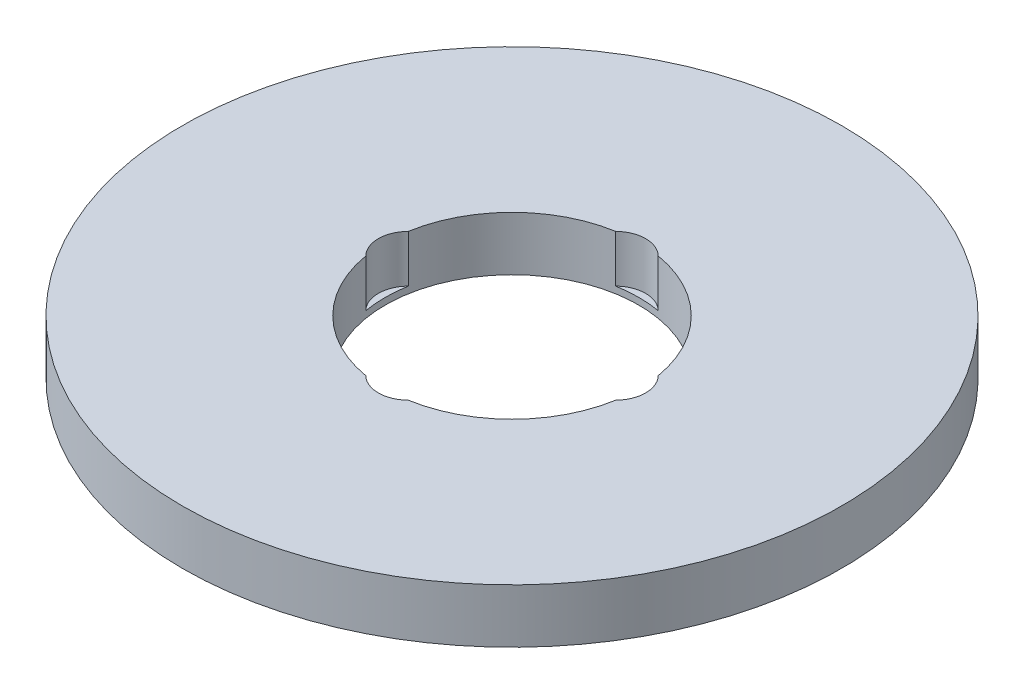
ISO-10303-21;
HEADER;
FILE_DESCRIPTION(('STEP AP214'),'2;1');
FILE_NAME('part.step','',(''),(''),'','','');
FILE_SCHEMA(('AUTOMOTIVE_DESIGN { 1 0 10303 214 1 1 1 1 }'));
ENDSEC;
DATA;
#1=APPLICATION_CONTEXT('core data for automotive mechanical design processes');
#2=APPLICATION_PROTOCOL_DEFINITION('international standard','automotive_design',2000,#1);
#3=PRODUCT_CONTEXT('',#1,'mechanical');
#4=PRODUCT('Part','Part','',(#3));
#5=PRODUCT_RELATED_PRODUCT_CATEGORY('part','',(#4));
#6=PRODUCT_DEFINITION_FORMATION('','',#4);
#7=PRODUCT_DEFINITION_CONTEXT('part definition',#1,'design');
#8=PRODUCT_DEFINITION('design','',#6,#7);
#9=PRODUCT_DEFINITION_SHAPE('','',#8);
#10=(LENGTH_UNIT() NAMED_UNIT(*) SI_UNIT(.MILLI.,.METRE.));
#11=(NAMED_UNIT(*) PLANE_ANGLE_UNIT() SI_UNIT($,.RADIAN.));
#12=(NAMED_UNIT(*) SI_UNIT($,.STERADIAN.) SOLID_ANGLE_UNIT());
#13=UNCERTAINTY_MEASURE_WITH_UNIT(LENGTH_MEASURE(1.E-05),#10,'distance_accuracy_value','');
#14=(GEOMETRIC_REPRESENTATION_CONTEXT(3) GLOBAL_UNCERTAINTY_ASSIGNED_CONTEXT((#13)) GLOBAL_UNIT_ASSIGNED_CONTEXT((#10,
#11,#12)) REPRESENTATION_CONTEXT('',''));
#15=CARTESIAN_POINT('',(0.,0.,0.));
#16=DIRECTION('',(0.,0.,1.));
#17=DIRECTION('',(1.,0.,0.));
#18=AXIS2_PLACEMENT_3D('',#15,#16,#17);
#19=CARTESIAN_POINT('',(0.,16.,0.));
#20=DIRECTION('',(0.,-1.,0.));
#21=DIRECTION('',(0.,0.,-1.));
#22=AXIS2_PLACEMENT_3D('',#19,#20,#21);
#23=CYLINDRICAL_SURFACE('',#22,97.5);
#24=CARTESIAN_POINT('',(0.,16.,0.));
#25=DIRECTION('',(0.,1.,0.));
#26=DIRECTION('',(0.,0.,1.));
#27=AXIS2_PLACEMENT_3D('',#24,#25,#26);
#28=CIRCLE('',#27,97.5);
#29=CARTESIAN_POINT('',(0.,16.,97.5));
#30=VERTEX_POINT('',#29);
#31=EDGE_CURVE('E148',#30,#30,#28,.T.);
#32=ORIENTED_EDGE('',*,*,#31,.F.);
#33=EDGE_LOOP('',(#32));
#34=FACE_BOUND('',#33,.T.);
#35=CARTESIAN_POINT('',(0.,0.,0.));
#36=DIRECTION('',(0.,1.,0.));
#37=DIRECTION('',(0.,0.,1.));
#38=AXIS2_PLACEMENT_3D('',#35,#36,#37);
#39=CIRCLE('',#38,97.5);
#40=CARTESIAN_POINT('',(0.,0.,97.5));
#41=VERTEX_POINT('',#40);
#42=EDGE_CURVE('E139',#41,#41,#39,.T.);
#43=ORIENTED_EDGE('',*,*,#42,.T.);
#44=EDGE_LOOP('',(#43));
#45=FACE_BOUND('',#44,.T.);
#46=ADVANCED_FACE('F39',(#34,#45),#23,.T.);
#47=CARTESIAN_POINT('',(0.,16.,0.));
#48=DIRECTION('',(0.,1.,0.));
#49=DIRECTION('',(0.,0.,1.));
#50=AXIS2_PLACEMENT_3D('',#47,#48,#49);
#51=PLANE('',#50);
#52=CARTESIAN_POINT('',(1.06638424816963E-13,16.,30.5424587640203));
#53=DIRECTION('',(0.,1.,0.));
#54=DIRECTION('',(1.,0.,0.));
#55=AXIS2_PLACEMENT_3D('',#52,#53,#54);
#56=CIRCLE('',#55,8.99695651911864);
#57=CARTESIAN_POINT('',(-6.29811100717771,16.,36.9673341984686));
#58=VERTEX_POINT('',#57);
#59=CARTESIAN_POINT('',(6.29811100717797,16.,36.9673341984686));
#60=VERTEX_POINT('',#59);
#61=EDGE_CURVE('E175',#58,#60,#56,.T.);
#62=ORIENTED_EDGE('',*,*,#61,.F.);
#63=CARTESIAN_POINT('',(0.,16.,0.));
#64=DIRECTION('',(0.,1.,0.));
#65=DIRECTION('',(0.,0.,1.));
#66=AXIS2_PLACEMENT_3D('',#63,#64,#65);
#67=CIRCLE('',#66,37.5);
#68=CARTESIAN_POINT('',(-36.9673341984686,16.,6.29811100717784));
#69=VERTEX_POINT('',#68);
#70=EDGE_CURVE('E134',#69,#58,#67,.T.);
#71=ORIENTED_EDGE('',*,*,#70,.F.);
#72=CARTESIAN_POINT('',(-30.5424587640203,16.,0.));
#73=DIRECTION('',(0.,1.,0.));
#74=DIRECTION('',(0.,0.,1.));
#75=AXIS2_PLACEMENT_3D('',#72,#73,#74);
#76=CIRCLE('',#75,8.99695651911864);
#77=CARTESIAN_POINT('',(-36.9673341984686,16.,-6.29811100717784));
#78=VERTEX_POINT('',#77);
#79=EDGE_CURVE('E143',#78,#69,#76,.T.);
#80=ORIENTED_EDGE('',*,*,#79,.F.);
#81=CARTESIAN_POINT('',(-6.29811100717823,16.,-36.9673341984685));
#82=VERTEX_POINT('',#81);
#83=EDGE_CURVE('E123',#82,#78,#67,.T.);
#84=ORIENTED_EDGE('',*,*,#83,.F.);
#85=CARTESIAN_POINT('',(-3.19915274450889E-13,16.,-30.5424587640203));
#86=DIRECTION('',(0.,1.,0.));
#87=DIRECTION('',(-1.,0.,0.));
#88=AXIS2_PLACEMENT_3D('',#85,#86,#87);
#89=CIRCLE('',#88,8.99695651911864);
#90=CARTESIAN_POINT('',(6.29811100717746,16.,-36.9673341984687));
#91=VERTEX_POINT('',#90);
#92=EDGE_CURVE('E106',#91,#82,#89,.T.);
#93=ORIENTED_EDGE('',*,*,#92,.F.);
#94=CARTESIAN_POINT('',(36.9673341984686,16.,-6.29811100717784));
#95=VERTEX_POINT('',#94);
#96=EDGE_CURVE('E125',#95,#91,#67,.T.);
#97=ORIENTED_EDGE('',*,*,#96,.F.);
#98=CARTESIAN_POINT('',(30.5424587640203,16.,0.));
#99=DIRECTION('',(0.,1.,0.));
#100=DIRECTION('',(0.,0.,-1.));
#101=AXIS2_PLACEMENT_3D('',#98,#99,#100);
#102=CIRCLE('',#101,8.99695651911864);
#103=CARTESIAN_POINT('',(36.9673341984686,16.,6.29811100717784));
#104=VERTEX_POINT('',#103);
#105=EDGE_CURVE('E286',#104,#95,#102,.T.);
#106=ORIENTED_EDGE('',*,*,#105,.F.);
#107=EDGE_CURVE('E135',#60,#104,#67,.T.);
#108=ORIENTED_EDGE('',*,*,#107,.F.);
#109=EDGE_LOOP('',(#62,#71,#80,#84,#93,#97,#106,#108));
#110=FACE_BOUND('',#109,.T.);
#111=ORIENTED_EDGE('',*,*,#31,.T.);
#112=EDGE_LOOP('',(#111));
#113=FACE_BOUND('',#112,.T.);
#114=ADVANCED_FACE('F118',(#110,#113),#51,.T.);
#115=CARTESIAN_POINT('',(0.,0.,0.));
#116=DIRECTION('',(0.,1.,0.));
#117=DIRECTION('',(0.,0.,1.));
#118=AXIS2_PLACEMENT_3D('',#115,#116,#117);
#119=PLANE('',#118);
#120=CARTESIAN_POINT('',(0.,0.,0.));
#121=DIRECTION('',(0.,1.,0.));
#122=DIRECTION('',(0.,0.,1.));
#123=AXIS2_PLACEMENT_3D('',#120,#121,#122);
#124=CIRCLE('',#123,37.5);
#125=CARTESIAN_POINT('',(0.,0.,37.5));
#126=VERTEX_POINT('',#125);
#127=EDGE_CURVE('E136',#126,#126,#124,.T.);
#128=ORIENTED_EDGE('',*,*,#127,.T.);
#129=EDGE_LOOP('',(#128));
#130=FACE_BOUND('',#129,.T.);
#131=ORIENTED_EDGE('',*,*,#42,.F.);
#132=EDGE_LOOP('',(#131));
#133=FACE_BOUND('',#132,.T.);
#134=ADVANCED_FACE('F187',(#130,#133),#119,.F.);
#135=CARTESIAN_POINT('',(0.,16.,0.));
#136=DIRECTION('',(0.,-1.,0.));
#137=DIRECTION('',(0.,0.,-1.));
#138=AXIS2_PLACEMENT_3D('',#135,#136,#137);
#139=CYLINDRICAL_SURFACE('',#138,37.5);
#140=DIRECTION('',(0.,1.,0.));
#141=VECTOR('',#140,1.);
#142=CARTESIAN_POINT('',(-6.29811100717771,8.98591771003932,36.9673341984686));
#143=LINE('',#142,#141);
#144=CARTESIAN_POINT('',(-6.29811100717771,1.97183542007863,36.9673341984686));
#145=VERTEX_POINT('',#144);
#146=EDGE_CURVE('E11',#145,#58,#143,.T.);
#147=ORIENTED_EDGE('',*,*,#146,.F.);
#148=CARTESIAN_POINT('',(0.,1.97183542007863,0.));
#149=DIRECTION('',(0.,1.,0.));
#150=DIRECTION('',(0.,0.,1.));
#151=AXIS2_PLACEMENT_3D('',#148,#149,#150);
#152=CIRCLE('',#151,37.5);
#153=CARTESIAN_POINT('',(6.29811100717797,1.97183542007863,36.9673341984686));
#154=VERTEX_POINT('',#153);
#155=EDGE_CURVE('E170',#145,#154,#152,.T.);
#156=ORIENTED_EDGE('',*,*,#155,.T.);
#157=DIRECTION('',(0.,1.,0.));
#158=VECTOR('',#157,1.);
#159=CARTESIAN_POINT('',(6.29811100717797,8.98591771003932,36.9673341984686));
#160=LINE('',#159,#158);
#161=EDGE_CURVE('E46',#60,#154,#160,.F.);
#162=ORIENTED_EDGE('',*,*,#161,.F.);
#163=ORIENTED_EDGE('',*,*,#107,.T.);
#164=DIRECTION('',(0.,1.,0.));
#165=VECTOR('',#164,1.);
#166=CARTESIAN_POINT('',(36.9673341984686,8.98591771003932,6.29811100717784));
#167=LINE('',#166,#165);
#168=CARTESIAN_POINT('',(36.9673341984686,1.97183542007863,6.29811100717784));
#169=VERTEX_POINT('',#168);
#170=EDGE_CURVE('E164',#169,#104,#167,.T.);
#171=ORIENTED_EDGE('',*,*,#170,.F.);
#172=CARTESIAN_POINT('',(0.,1.97183542007863,0.));
#173=DIRECTION('',(0.,1.,0.));
#174=DIRECTION('',(0.,0.,1.));
#175=AXIS2_PLACEMENT_3D('',#172,#173,#174);
#176=CIRCLE('',#175,37.5);
#177=CARTESIAN_POINT('',(36.9673341984686,1.97183542007863,-6.29811100717784));
#178=VERTEX_POINT('',#177);
#179=EDGE_CURVE('E115',#169,#178,#176,.T.);
#180=ORIENTED_EDGE('',*,*,#179,.T.);
#181=DIRECTION('',(0.,1.,0.));
#182=VECTOR('',#181,1.);
#183=CARTESIAN_POINT('',(36.9673341984686,8.98591771003932,-6.29811100717784));
#184=LINE('',#183,#182);
#185=EDGE_CURVE('E131',#95,#178,#184,.F.);
#186=ORIENTED_EDGE('',*,*,#185,.F.);
#187=ORIENTED_EDGE('',*,*,#96,.T.);
#188=DIRECTION('',(0.,1.,0.));
#189=VECTOR('',#188,1.);
#190=CARTESIAN_POINT('',(6.29811100717746,8.98591771003932,-36.9673341984687));
#191=LINE('',#190,#189);
#192=CARTESIAN_POINT('',(6.29811100717746,1.97183542007863,-36.9673341984687));
#193=VERTEX_POINT('',#192);
#194=EDGE_CURVE('E105',#193,#91,#191,.T.);
#195=ORIENTED_EDGE('',*,*,#194,.F.);
#196=CARTESIAN_POINT('',(0.,1.97183542007863,0.));
#197=DIRECTION('',(0.,1.,0.));
#198=DIRECTION('',(0.,0.,1.));
#199=AXIS2_PLACEMENT_3D('',#196,#197,#198);
#200=CIRCLE('',#199,37.5);
#201=CARTESIAN_POINT('',(-6.29811100717823,1.97183542007863,-36.9673341984685));
#202=VERTEX_POINT('',#201);
#203=EDGE_CURVE('E159',#193,#202,#200,.T.);
#204=ORIENTED_EDGE('',*,*,#203,.T.);
#205=DIRECTION('',(0.,1.,0.));
#206=VECTOR('',#205,1.);
#207=CARTESIAN_POINT('',(-6.29811100717823,8.98591771003932,-36.9673341984685));
#208=LINE('',#207,#206);
#209=EDGE_CURVE('E114',#82,#202,#208,.F.);
#210=ORIENTED_EDGE('',*,*,#209,.F.);
#211=ORIENTED_EDGE('',*,*,#83,.T.);
#212=DIRECTION('',(0.,1.,0.));
#213=VECTOR('',#212,1.);
#214=CARTESIAN_POINT('',(-36.9673341984686,8.98591771003932,-6.29811100717784));
#215=LINE('',#214,#213);
#216=CARTESIAN_POINT('',(-36.9673341984686,1.97183542007863,-6.29811100717784));
#217=VERTEX_POINT('',#216);
#218=EDGE_CURVE('E160',#217,#78,#215,.T.);
#219=ORIENTED_EDGE('',*,*,#218,.F.);
#220=CARTESIAN_POINT('',(0.,1.97183542007863,0.));
#221=DIRECTION('',(0.,1.,0.));
#222=DIRECTION('',(0.,0.,1.));
#223=AXIS2_PLACEMENT_3D('',#220,#221,#222);
#224=CIRCLE('',#223,37.5);
#225=CARTESIAN_POINT('',(-36.9673341984686,1.97183542007863,6.29811100717784));
#226=VERTEX_POINT('',#225);
#227=EDGE_CURVE('E149',#217,#226,#224,.T.);
#228=ORIENTED_EDGE('',*,*,#227,.T.);
#229=DIRECTION('',(0.,1.,0.));
#230=VECTOR('',#229,1.);
#231=CARTESIAN_POINT('',(-36.9673341984686,8.98591771003932,6.29811100717784));
#232=LINE('',#231,#230);
#233=EDGE_CURVE('E152',#69,#226,#232,.F.);
#234=ORIENTED_EDGE('',*,*,#233,.F.);
#235=ORIENTED_EDGE('',*,*,#70,.T.);
#236=EDGE_LOOP('',(#147,#156,#162,#163,#171,#180,#186,#187,#195,#204,#210,#211,#219,#228,#234,#235));
#237=FACE_BOUND('',#236,.T.);
#238=ORIENTED_EDGE('',*,*,#127,.F.);
#239=EDGE_LOOP('',(#238));
#240=FACE_BOUND('',#239,.T.);
#241=ADVANCED_FACE('F126',(#237,#240),#139,.F.);
#242=CARTESIAN_POINT('',(-30.5424587640203,1.97183542007863,0.));
#243=DIRECTION('',(0.,1.,0.));
#244=DIRECTION('',(0.,0.,1.));
#245=AXIS2_PLACEMENT_3D('',#242,#243,#244);
#246=CYLINDRICAL_SURFACE('',#245,8.99695651911864);
#247=ORIENTED_EDGE('',*,*,#218,.T.);
#248=ORIENTED_EDGE('',*,*,#79,.T.);
#249=ORIENTED_EDGE('',*,*,#233,.T.);
#250=CARTESIAN_POINT('',(-30.5424587640203,1.97183542007863,0.));
#251=DIRECTION('',(0.,1.,0.));
#252=DIRECTION('',(0.,0.,1.));
#253=AXIS2_PLACEMENT_3D('',#250,#251,#252);
#254=CIRCLE('',#253,8.99695651911864);
#255=EDGE_CURVE('E144',#217,#226,#254,.T.);
#256=ORIENTED_EDGE('',*,*,#255,.F.);
#257=EDGE_LOOP('',(#247,#248,#249,#256));
#258=FACE_BOUND('',#257,.T.);
#259=ADVANCED_FACE('F200',(#258),#246,.F.);
#260=CARTESIAN_POINT('',(-30.5424587640203,1.97183542007863,0.));
#261=DIRECTION('',(0.,1.,0.));
#262=DIRECTION('',(0.,0.,1.));
#263=AXIS2_PLACEMENT_3D('',#260,#261,#262);
#264=PLANE('',#263);
#265=ORIENTED_EDGE('',*,*,#255,.T.);
#266=ORIENTED_EDGE('',*,*,#227,.F.);
#267=EDGE_LOOP('',(#265,#266));
#268=FACE_BOUND('',#267,.T.);
#269=ADVANCED_FACE('F201',(#268),#264,.T.);
#270=CARTESIAN_POINT('',(-3.19915274450889E-13,1.97183542007863,-30.5424587640203));
#271=DIRECTION('',(0.,1.,0.));
#272=DIRECTION('',(0.,0.,1.));
#273=AXIS2_PLACEMENT_3D('',#270,#271,#272);
#274=CYLINDRICAL_SURFACE('',#273,8.99695651911864);
#275=ORIENTED_EDGE('',*,*,#194,.T.);
#276=ORIENTED_EDGE('',*,*,#92,.T.);
#277=ORIENTED_EDGE('',*,*,#209,.T.);
#278=CARTESIAN_POINT('',(-3.19915274450889E-13,1.97183542007863,-30.5424587640203));
#279=DIRECTION('',(0.,1.,0.));
#280=DIRECTION('',(-1.,0.,0.));
#281=AXIS2_PLACEMENT_3D('',#278,#279,#280);
#282=CIRCLE('',#281,8.99695651911864);
#283=EDGE_CURVE('E107',#193,#202,#282,.T.);
#284=ORIENTED_EDGE('',*,*,#283,.F.);
#285=EDGE_LOOP('',(#275,#276,#277,#284));
#286=FACE_BOUND('',#285,.T.);
#287=ADVANCED_FACE('F102',(#286),#274,.F.);
#288=CARTESIAN_POINT('',(-3.19915274450889E-13,1.97183542007863,-30.5424587640203));
#289=DIRECTION('',(0.,1.,0.));
#290=DIRECTION('',(-1.,0.,0.));
#291=AXIS2_PLACEMENT_3D('',#288,#289,#290);
#292=PLANE('',#291);
#293=ORIENTED_EDGE('',*,*,#283,.T.);
#294=ORIENTED_EDGE('',*,*,#203,.F.);
#295=EDGE_LOOP('',(#293,#294));
#296=FACE_BOUND('',#295,.T.);
#297=ADVANCED_FACE('F209',(#296),#292,.T.);
#298=CARTESIAN_POINT('',(30.5424587640203,1.97183542007863,0.));
#299=DIRECTION('',(0.,1.,0.));
#300=DIRECTION('',(0.,0.,1.));
#301=AXIS2_PLACEMENT_3D('',#298,#299,#300);
#302=CYLINDRICAL_SURFACE('',#301,8.99695651911864);
#303=ORIENTED_EDGE('',*,*,#170,.T.);
#304=ORIENTED_EDGE('',*,*,#105,.T.);
#305=ORIENTED_EDGE('',*,*,#185,.T.);
#306=CARTESIAN_POINT('',(30.5424587640203,1.97183542007863,0.));
#307=DIRECTION('',(0.,1.,0.));
#308=DIRECTION('',(0.,0.,-1.));
#309=AXIS2_PLACEMENT_3D('',#306,#307,#308);
#310=CIRCLE('',#309,8.99695651911864);
#311=EDGE_CURVE('E56',#169,#178,#310,.T.);
#312=ORIENTED_EDGE('',*,*,#311,.F.);
#313=EDGE_LOOP('',(#303,#304,#305,#312));
#314=FACE_BOUND('',#313,.T.);
#315=ADVANCED_FACE('F213',(#314),#302,.F.);
#316=CARTESIAN_POINT('',(30.5424587640203,1.97183542007863,0.));
#317=DIRECTION('',(0.,1.,0.));
#318=DIRECTION('',(0.,0.,-1.));
#319=AXIS2_PLACEMENT_3D('',#316,#317,#318);
#320=PLANE('',#319);
#321=ORIENTED_EDGE('',*,*,#311,.T.);
#322=ORIENTED_EDGE('',*,*,#179,.F.);
#323=EDGE_LOOP('',(#321,#322));
#324=FACE_BOUND('',#323,.T.);
#325=ADVANCED_FACE('F179',(#324),#320,.T.);
#326=CARTESIAN_POINT('',(1.06638424816963E-13,1.97183542007863,30.5424587640203));
#327=DIRECTION('',(0.,1.,0.));
#328=DIRECTION('',(0.,0.,1.));
#329=AXIS2_PLACEMENT_3D('',#326,#327,#328);
#330=CYLINDRICAL_SURFACE('',#329,8.99695651911864);
#331=ORIENTED_EDGE('',*,*,#146,.T.);
#332=ORIENTED_EDGE('',*,*,#61,.T.);
#333=ORIENTED_EDGE('',*,*,#161,.T.);
#334=CARTESIAN_POINT('',(1.06638424816963E-13,1.97183542007863,30.5424587640203));
#335=DIRECTION('',(0.,1.,0.));
#336=DIRECTION('',(1.,0.,0.));
#337=AXIS2_PLACEMENT_3D('',#334,#335,#336);
#338=CIRCLE('',#337,8.99695651911864);
#339=EDGE_CURVE('E55',#145,#154,#338,.T.);
#340=ORIENTED_EDGE('',*,*,#339,.F.);
#341=EDGE_LOOP('',(#331,#332,#333,#340));
#342=FACE_BOUND('',#341,.T.);
#343=ADVANCED_FACE('F171',(#342),#330,.F.);
#344=CARTESIAN_POINT('',(1.06638424816963E-13,1.97183542007863,30.5424587640203));
#345=DIRECTION('',(0.,1.,0.));
#346=DIRECTION('',(1.,0.,0.));
#347=AXIS2_PLACEMENT_3D('',#344,#345,#346);
#348=PLANE('',#347);
#349=ORIENTED_EDGE('',*,*,#339,.T.);
#350=ORIENTED_EDGE('',*,*,#155,.F.);
#351=EDGE_LOOP('',(#349,#350));
#352=FACE_BOUND('',#351,.T.);
#353=ADVANCED_FACE('F173',(#352),#348,.T.);
#354=CLOSED_SHELL('',(#46,#114,#134,#241,#259,#269,#287,#297,#315,#325,#343,#353));
#355=MANIFOLD_SOLID_BREP('B2',#354);
#356=ADVANCED_BREP_SHAPE_REPRESENTATION('',(#18,#355),#14);
#357=SHAPE_DEFINITION_REPRESENTATION(#9,#356);
ENDSEC;
END-ISO-10303-21;
